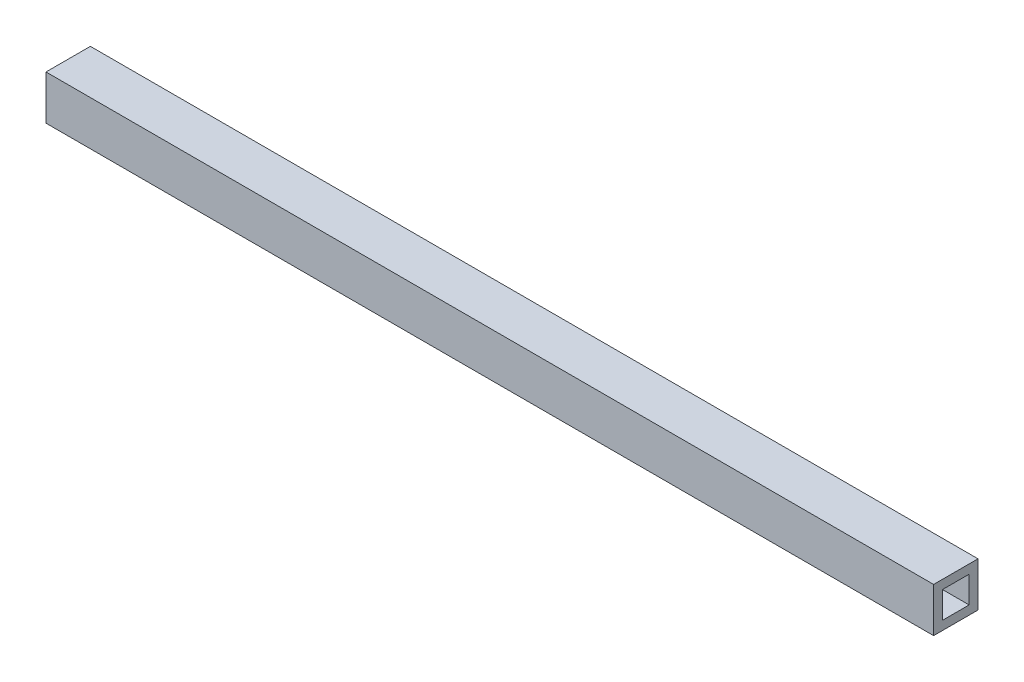
ISO-10303-21;
HEADER;
FILE_DESCRIPTION(('STEP AP214'),'2;1');
FILE_NAME('part.step','',(''),(''),'','','');
FILE_SCHEMA(('AUTOMOTIVE_DESIGN { 1 0 10303 214 1 1 1 1 }'));
ENDSEC;
DATA;
#1=APPLICATION_CONTEXT('core data for automotive mechanical design processes');
#2=APPLICATION_PROTOCOL_DEFINITION('international standard','automotive_design',2000,#1);
#3=PRODUCT_CONTEXT('',#1,'mechanical');
#4=PRODUCT('Part','Part','',(#3));
#5=PRODUCT_RELATED_PRODUCT_CATEGORY('part','',(#4));
#6=PRODUCT_DEFINITION_FORMATION('','',#4);
#7=PRODUCT_DEFINITION_CONTEXT('part definition',#1,'design');
#8=PRODUCT_DEFINITION('design','',#6,#7);
#9=PRODUCT_DEFINITION_SHAPE('','',#8);
#10=(LENGTH_UNIT() NAMED_UNIT(*) SI_UNIT(.MILLI.,.METRE.));
#11=(NAMED_UNIT(*) PLANE_ANGLE_UNIT() SI_UNIT($,.RADIAN.));
#12=(NAMED_UNIT(*) SI_UNIT($,.STERADIAN.) SOLID_ANGLE_UNIT());
#13=UNCERTAINTY_MEASURE_WITH_UNIT(LENGTH_MEASURE(1.E-05),#10,'distance_accuracy_value','');
#14=(GEOMETRIC_REPRESENTATION_CONTEXT(3) GLOBAL_UNCERTAINTY_ASSIGNED_CONTEXT((#13)) GLOBAL_UNIT_ASSIGNED_CONTEXT((#10,
#11,#12)) REPRESENTATION_CONTEXT('',''));
#15=CARTESIAN_POINT('',(0.,0.,0.));
#16=DIRECTION('',(0.,0.,1.));
#17=DIRECTION('',(1.,0.,0.));
#18=AXIS2_PLACEMENT_3D('',#15,#16,#17);
#19=CARTESIAN_POINT('',(500.,-12.5,-12.5));
#20=DIRECTION('',(0.,0.,1.));
#21=DIRECTION('',(1.,0.,0.));
#22=AXIS2_PLACEMENT_3D('',#19,#20,#21);
#23=PLANE('',#22);
#24=DIRECTION('',(0.,1.,0.));
#25=VECTOR('',#24,1.);
#26=CARTESIAN_POINT('',(0.,-12.5,-12.5));
#27=LINE('',#26,#25);
#28=CARTESIAN_POINT('',(0.,-12.5,-12.5));
#29=VERTEX_POINT('',#28);
#30=CARTESIAN_POINT('',(0.,12.5,-12.5));
#31=VERTEX_POINT('',#30);
#32=EDGE_CURVE('E130',#29,#31,#27,.T.);
#33=ORIENTED_EDGE('',*,*,#32,.T.);
#34=DIRECTION('',(-1.,0.,0.));
#35=VECTOR('',#34,1.);
#36=CARTESIAN_POINT('',(500.,12.5,-12.5));
#37=LINE('',#36,#35);
#38=CARTESIAN_POINT('',(500.,12.5,-12.5));
#39=VERTEX_POINT('',#38);
#40=EDGE_CURVE('E11',#39,#31,#37,.T.);
#41=ORIENTED_EDGE('',*,*,#40,.F.);
#42=DIRECTION('',(0.,1.,0.));
#43=VECTOR('',#42,1.);
#44=CARTESIAN_POINT('',(500.,-12.5,-12.5));
#45=LINE('',#44,#43);
#46=CARTESIAN_POINT('',(500.,-12.5,-12.5));
#47=VERTEX_POINT('',#46);
#48=EDGE_CURVE('E134',#47,#39,#45,.T.);
#49=ORIENTED_EDGE('',*,*,#48,.F.);
#50=DIRECTION('',(-1.,0.,0.));
#51=VECTOR('',#50,1.);
#52=CARTESIAN_POINT('',(500.,-12.5,-12.5));
#53=LINE('',#52,#51);
#54=EDGE_CURVE('E144',#47,#29,#53,.T.);
#55=ORIENTED_EDGE('',*,*,#54,.T.);
#56=EDGE_LOOP('',(#33,#41,#49,#55));
#57=FACE_BOUND('',#56,.T.);
#58=ADVANCED_FACE('F33',(#57),#23,.F.);
#59=CARTESIAN_POINT('',(500.,12.5,12.5));
#60=DIRECTION('',(0.,-1.,0.));
#61=DIRECTION('',(0.,0.,-1.));
#62=AXIS2_PLACEMENT_3D('',#59,#60,#61);
#63=PLANE('',#62);
#64=DIRECTION('',(0.,0.,1.));
#65=VECTOR('',#64,1.);
#66=CARTESIAN_POINT('',(0.,12.5,12.5));
#67=LINE('',#66,#65);
#68=CARTESIAN_POINT('',(0.,12.5,12.5));
#69=VERTEX_POINT('',#68);
#70=EDGE_CURVE('E147',#31,#69,#67,.T.);
#71=ORIENTED_EDGE('',*,*,#70,.T.);
#72=DIRECTION('',(-1.,0.,0.));
#73=VECTOR('',#72,1.);
#74=CARTESIAN_POINT('',(500.,12.5,12.5));
#75=LINE('',#74,#73);
#76=CARTESIAN_POINT('',(500.,12.5,12.5));
#77=VERTEX_POINT('',#76);
#78=EDGE_CURVE('E40',#77,#69,#75,.T.);
#79=ORIENTED_EDGE('',*,*,#78,.F.);
#80=DIRECTION('',(0.,0.,1.));
#81=VECTOR('',#80,1.);
#82=CARTESIAN_POINT('',(500.,12.5,12.5));
#83=LINE('',#82,#81);
#84=EDGE_CURVE('E137',#39,#77,#83,.T.);
#85=ORIENTED_EDGE('',*,*,#84,.F.);
#86=ORIENTED_EDGE('',*,*,#40,.T.);
#87=EDGE_LOOP('',(#71,#79,#85,#86));
#88=FACE_BOUND('',#87,.T.);
#89=ADVANCED_FACE('F175',(#88),#63,.F.);
#90=CARTESIAN_POINT('',(500.,-12.5,12.5));
#91=DIRECTION('',(0.,0.,-1.));
#92=DIRECTION('',(-1.,0.,0.));
#93=AXIS2_PLACEMENT_3D('',#90,#91,#92);
#94=PLANE('',#93);
#95=DIRECTION('',(0.,-1.,0.));
#96=VECTOR('',#95,1.);
#97=CARTESIAN_POINT('',(0.,-12.5,12.5));
#98=LINE('',#97,#96);
#99=CARTESIAN_POINT('',(0.,-12.5,12.5));
#100=VERTEX_POINT('',#99);
#101=EDGE_CURVE('E149',#69,#100,#98,.T.);
#102=ORIENTED_EDGE('',*,*,#101,.T.);
#103=DIRECTION('',(-1.,0.,0.));
#104=VECTOR('',#103,1.);
#105=CARTESIAN_POINT('',(500.,-12.5,12.5));
#106=LINE('',#105,#104);
#107=CARTESIAN_POINT('',(500.,-12.5,12.5));
#108=VERTEX_POINT('',#107);
#109=EDGE_CURVE('E154',#108,#100,#106,.T.);
#110=ORIENTED_EDGE('',*,*,#109,.F.);
#111=DIRECTION('',(0.,-1.,0.));
#112=VECTOR('',#111,1.);
#113=CARTESIAN_POINT('',(500.,-12.5,12.5));
#114=LINE('',#113,#112);
#115=EDGE_CURVE('E140',#77,#108,#114,.T.);
#116=ORIENTED_EDGE('',*,*,#115,.F.);
#117=ORIENTED_EDGE('',*,*,#78,.T.);
#118=EDGE_LOOP('',(#102,#110,#116,#117));
#119=FACE_BOUND('',#118,.T.);
#120=ADVANCED_FACE('F161',(#119),#94,.F.);
#121=CARTESIAN_POINT('',(500.,-12.5,12.5));
#122=DIRECTION('',(0.,1.,0.));
#123=DIRECTION('',(0.,0.,1.));
#124=AXIS2_PLACEMENT_3D('',#121,#122,#123);
#125=PLANE('',#124);
#126=DIRECTION('',(0.,0.,-1.));
#127=VECTOR('',#126,1.);
#128=CARTESIAN_POINT('',(0.,-12.5,12.5));
#129=LINE('',#128,#127);
#130=EDGE_CURVE('E138',#100,#29,#129,.T.);
#131=ORIENTED_EDGE('',*,*,#130,.T.);
#132=ORIENTED_EDGE('',*,*,#54,.F.);
#133=DIRECTION('',(0.,0.,-1.));
#134=VECTOR('',#133,1.);
#135=CARTESIAN_POINT('',(500.,-12.5,12.5));
#136=LINE('',#135,#134);
#137=EDGE_CURVE('E142',#108,#47,#136,.T.);
#138=ORIENTED_EDGE('',*,*,#137,.F.);
#139=ORIENTED_EDGE('',*,*,#109,.T.);
#140=EDGE_LOOP('',(#131,#132,#138,#139));
#141=FACE_BOUND('',#140,.T.);
#142=ADVANCED_FACE('F168',(#141),#125,.F.);
#143=CARTESIAN_POINT('',(500.,0.,0.));
#144=DIRECTION('',(-1.,0.,0.));
#145=DIRECTION('',(0.,0.,1.));
#146=AXIS2_PLACEMENT_3D('',#143,#144,#145);
#147=PLANE('',#146);
#148=DIRECTION('',(0.,0.,1.));
#149=VECTOR('',#148,1.);
#150=CARTESIAN_POINT('',(500.,7.5,7.5));
#151=LINE('',#150,#149);
#152=CARTESIAN_POINT('',(500.,7.5,-7.5));
#153=VERTEX_POINT('',#152);
#154=CARTESIAN_POINT('',(500.,7.5,7.5));
#155=VERTEX_POINT('',#154);
#156=EDGE_CURVE('E124',#153,#155,#151,.T.);
#157=ORIENTED_EDGE('',*,*,#156,.F.);
#158=DIRECTION('',(0.,1.,0.));
#159=VECTOR('',#158,1.);
#160=CARTESIAN_POINT('',(500.,-7.5,-7.5));
#161=LINE('',#160,#159);
#162=CARTESIAN_POINT('',(500.,-7.5,-7.5));
#163=VERTEX_POINT('',#162);
#164=EDGE_CURVE('E47',#163,#153,#161,.T.);
#165=ORIENTED_EDGE('',*,*,#164,.F.);
#166=DIRECTION('',(0.,0.,-1.));
#167=VECTOR('',#166,1.);
#168=CARTESIAN_POINT('',(500.,-7.5,7.5));
#169=LINE('',#168,#167);
#170=CARTESIAN_POINT('',(500.,-7.5,7.5));
#171=VERTEX_POINT('',#170);
#172=EDGE_CURVE('E115',#171,#163,#169,.T.);
#173=ORIENTED_EDGE('',*,*,#172,.F.);
#174=DIRECTION('',(0.,-1.,0.));
#175=VECTOR('',#174,1.);
#176=CARTESIAN_POINT('',(500.,-7.5,7.5));
#177=LINE('',#176,#175);
#178=EDGE_CURVE('E118',#155,#171,#177,.T.);
#179=ORIENTED_EDGE('',*,*,#178,.F.);
#180=EDGE_LOOP('',(#157,#165,#173,#179));
#181=FACE_BOUND('',#180,.T.);
#182=ORIENTED_EDGE('',*,*,#48,.T.);
#183=ORIENTED_EDGE('',*,*,#84,.T.);
#184=ORIENTED_EDGE('',*,*,#115,.T.);
#185=ORIENTED_EDGE('',*,*,#137,.T.);
#186=EDGE_LOOP('',(#182,#183,#184,#185));
#187=FACE_BOUND('',#186,.T.);
#188=ADVANCED_FACE('F174',(#181,#187),#147,.F.);
#189=CARTESIAN_POINT('',(0.,0.,0.));
#190=DIRECTION('',(-1.,0.,0.));
#191=DIRECTION('',(0.,0.,1.));
#192=AXIS2_PLACEMENT_3D('',#189,#190,#191);
#193=PLANE('',#192);
#194=DIRECTION('',(0.,1.,0.));
#195=VECTOR('',#194,1.);
#196=CARTESIAN_POINT('',(0.,-7.5,-7.5));
#197=LINE('',#196,#195);
#198=CARTESIAN_POINT('',(0.,-7.5,-7.5));
#199=VERTEX_POINT('',#198);
#200=CARTESIAN_POINT('',(0.,7.5,-7.5));
#201=VERTEX_POINT('',#200);
#202=EDGE_CURVE('E99',#199,#201,#197,.T.);
#203=ORIENTED_EDGE('',*,*,#202,.T.);
#204=DIRECTION('',(0.,0.,1.));
#205=VECTOR('',#204,1.);
#206=CARTESIAN_POINT('',(0.,7.5,7.5));
#207=LINE('',#206,#205);
#208=CARTESIAN_POINT('',(0.,7.5,7.5));
#209=VERTEX_POINT('',#208);
#210=EDGE_CURVE('E108',#201,#209,#207,.T.);
#211=ORIENTED_EDGE('',*,*,#210,.T.);
#212=DIRECTION('',(0.,-1.,0.));
#213=VECTOR('',#212,1.);
#214=CARTESIAN_POINT('',(0.,-7.5,7.5));
#215=LINE('',#214,#213);
#216=CARTESIAN_POINT('',(0.,-7.5,7.5));
#217=VERTEX_POINT('',#216);
#218=EDGE_CURVE('E55',#209,#217,#215,.T.);
#219=ORIENTED_EDGE('',*,*,#218,.T.);
#220=DIRECTION('',(0.,0.,-1.));
#221=VECTOR('',#220,1.);
#222=CARTESIAN_POINT('',(0.,-7.5,7.5));
#223=LINE('',#222,#221);
#224=EDGE_CURVE('E105',#217,#199,#223,.T.);
#225=ORIENTED_EDGE('',*,*,#224,.T.);
#226=EDGE_LOOP('',(#203,#211,#219,#225));
#227=FACE_BOUND('',#226,.T.);
#228=ORIENTED_EDGE('',*,*,#32,.F.);
#229=ORIENTED_EDGE('',*,*,#130,.F.);
#230=ORIENTED_EDGE('',*,*,#101,.F.);
#231=ORIENTED_EDGE('',*,*,#70,.F.);
#232=EDGE_LOOP('',(#228,#229,#230,#231));
#233=FACE_BOUND('',#232,.T.);
#234=ADVANCED_FACE('F112',(#227,#233),#193,.T.);
#235=CARTESIAN_POINT('',(0.,-7.5,-7.5));
#236=DIRECTION('',(0.,0.,-1.));
#237=DIRECTION('',(-1.,0.,0.));
#238=AXIS2_PLACEMENT_3D('',#235,#236,#237);
#239=PLANE('',#238);
#240=ORIENTED_EDGE('',*,*,#164,.T.);
#241=DIRECTION('',(1.,0.,0.));
#242=VECTOR('',#241,1.);
#243=CARTESIAN_POINT('',(0.,7.5,-7.5));
#244=LINE('',#243,#242);
#245=EDGE_CURVE('E95',#201,#153,#244,.T.);
#246=ORIENTED_EDGE('',*,*,#245,.F.);
#247=ORIENTED_EDGE('',*,*,#202,.F.);
#248=DIRECTION('',(1.,0.,0.));
#249=VECTOR('',#248,1.);
#250=CARTESIAN_POINT('',(0.,-7.5,-7.5));
#251=LINE('',#250,#249);
#252=EDGE_CURVE('E128',#199,#163,#251,.T.);
#253=ORIENTED_EDGE('',*,*,#252,.T.);
#254=EDGE_LOOP('',(#240,#246,#247,#253));
#255=FACE_BOUND('',#254,.T.);
#256=ADVANCED_FACE('F97',(#255),#239,.F.);
#257=CARTESIAN_POINT('',(0.,-7.5,7.5));
#258=DIRECTION('',(0.,-1.,0.));
#259=DIRECTION('',(0.,0.,-1.));
#260=AXIS2_PLACEMENT_3D('',#257,#258,#259);
#261=PLANE('',#260);
#262=ORIENTED_EDGE('',*,*,#172,.T.);
#263=ORIENTED_EDGE('',*,*,#252,.F.);
#264=ORIENTED_EDGE('',*,*,#224,.F.);
#265=DIRECTION('',(1.,0.,0.));
#266=VECTOR('',#265,1.);
#267=CARTESIAN_POINT('',(0.,-7.5,7.5));
#268=LINE('',#267,#266);
#269=EDGE_CURVE('E131',#217,#171,#268,.T.);
#270=ORIENTED_EDGE('',*,*,#269,.T.);
#271=EDGE_LOOP('',(#262,#263,#264,#270));
#272=FACE_BOUND('',#271,.T.);
#273=ADVANCED_FACE('F192',(#272),#261,.F.);
#274=CARTESIAN_POINT('',(0.,-7.5,7.5));
#275=DIRECTION('',(0.,0.,1.));
#276=DIRECTION('',(1.,0.,0.));
#277=AXIS2_PLACEMENT_3D('',#274,#275,#276);
#278=PLANE('',#277);
#279=ORIENTED_EDGE('',*,*,#178,.T.);
#280=ORIENTED_EDGE('',*,*,#269,.F.);
#281=ORIENTED_EDGE('',*,*,#218,.F.);
#282=DIRECTION('',(1.,0.,0.));
#283=VECTOR('',#282,1.);
#284=CARTESIAN_POINT('',(0.,7.5,7.5));
#285=LINE('',#284,#283);
#286=EDGE_CURVE('E104',#209,#155,#285,.T.);
#287=ORIENTED_EDGE('',*,*,#286,.T.);
#288=EDGE_LOOP('',(#279,#280,#281,#287));
#289=FACE_BOUND('',#288,.T.);
#290=ADVANCED_FACE('F195',(#289),#278,.F.);
#291=CARTESIAN_POINT('',(0.,7.5,7.5));
#292=DIRECTION('',(0.,1.,0.));
#293=DIRECTION('',(0.,0.,1.));
#294=AXIS2_PLACEMENT_3D('',#291,#292,#293);
#295=PLANE('',#294);
#296=ORIENTED_EDGE('',*,*,#156,.T.);
#297=ORIENTED_EDGE('',*,*,#286,.F.);
#298=ORIENTED_EDGE('',*,*,#210,.F.);
#299=ORIENTED_EDGE('',*,*,#245,.T.);
#300=EDGE_LOOP('',(#296,#297,#298,#299));
#301=FACE_BOUND('',#300,.T.);
#302=ADVANCED_FACE('F109',(#301),#295,.F.);
#303=CLOSED_SHELL('',(#58,#89,#120,#142,#188,#234,#256,#273,#290,#302));
#304=MANIFOLD_SOLID_BREP('B2',#303);
#305=ADVANCED_BREP_SHAPE_REPRESENTATION('',(#18,#304),#14);
#306=SHAPE_DEFINITION_REPRESENTATION(#9,#305);
ENDSEC;
END-ISO-10303-21;
